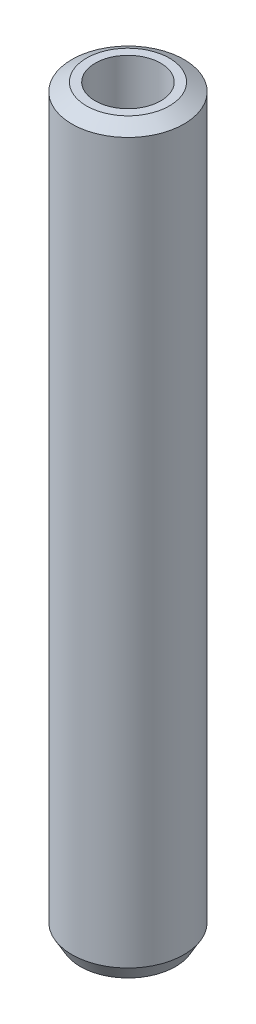
ISO-10303-21;
HEADER;
FILE_DESCRIPTION(('STEP AP214'),'2;1');
FILE_NAME('part.step','',(''),(''),'','','');
FILE_SCHEMA(('AUTOMOTIVE_DESIGN { 1 0 10303 214 1 1 1 1 }'));
ENDSEC;
DATA;
#1=APPLICATION_CONTEXT('core data for automotive mechanical design processes');
#2=APPLICATION_PROTOCOL_DEFINITION('international standard','automotive_design',2000,#1);
#3=PRODUCT_CONTEXT('',#1,'mechanical');
#4=PRODUCT('Part','Part','',(#3));
#5=PRODUCT_RELATED_PRODUCT_CATEGORY('part','',(#4));
#6=PRODUCT_DEFINITION_FORMATION('','',#4);
#7=PRODUCT_DEFINITION_CONTEXT('part definition',#1,'design');
#8=PRODUCT_DEFINITION('design','',#6,#7);
#9=PRODUCT_DEFINITION_SHAPE('','',#8);
#10=(LENGTH_UNIT() NAMED_UNIT(*) SI_UNIT(.MILLI.,.METRE.));
#11=(NAMED_UNIT(*) PLANE_ANGLE_UNIT() SI_UNIT($,.RADIAN.));
#12=(NAMED_UNIT(*) SI_UNIT($,.STERADIAN.) SOLID_ANGLE_UNIT());
#13=UNCERTAINTY_MEASURE_WITH_UNIT(LENGTH_MEASURE(1.E-05),#10,'distance_accuracy_value','');
#14=(GEOMETRIC_REPRESENTATION_CONTEXT(3) GLOBAL_UNCERTAINTY_ASSIGNED_CONTEXT((#13)) GLOBAL_UNIT_ASSIGNED_CONTEXT((#10,
#11,#12)) REPRESENTATION_CONTEXT('',''));
#15=CARTESIAN_POINT('',(0.,0.,0.));
#16=DIRECTION('',(0.,0.,1.));
#17=DIRECTION('',(1.,0.,0.));
#18=AXIS2_PLACEMENT_3D('',#15,#16,#17);
#19=CARTESIAN_POINT('',(0.,132.510919683854,0.));
#20=DIRECTION('',(0.,-1.,0.));
#21=DIRECTION('',(0.,0.,-1.));
#22=AXIS2_PLACEMENT_3D('',#19,#20,#21);
#23=CYLINDRICAL_SURFACE('',#22,10.);
#24=CARTESIAN_POINT('',(0.,131.008817441883,0.));
#25=DIRECTION('',(0.,1.,0.));
#26=DIRECTION('',(0.,0.,1.));
#27=AXIS2_PLACEMENT_3D('',#24,#25,#26);
#28=CIRCLE('',#27,10.);
#29=CARTESIAN_POINT('',(0.,131.008817441883,10.));
#30=VERTEX_POINT('',#29);
#31=EDGE_CURVE('E50',#30,#30,#28,.F.);
#32=ORIENTED_EDGE('',*,*,#31,.T.);
#33=EDGE_LOOP('',(#32));
#34=FACE_BOUND('',#33,.T.);
#35=CARTESIAN_POINT('',(0.,2.60171740125673,0.));
#36=DIRECTION('',(0.,1.,0.));
#37=DIRECTION('',(0.,0.,1.));
#38=AXIS2_PLACEMENT_3D('',#35,#36,#37);
#39=CIRCLE('',#38,10.);
#40=CARTESIAN_POINT('',(0.,2.60171740125673,10.));
#41=VERTEX_POINT('',#40);
#42=EDGE_CURVE('E51',#41,#41,#39,.T.);
#43=ORIENTED_EDGE('',*,*,#42,.T.);
#44=EDGE_LOOP('',(#43));
#45=FACE_BOUND('',#44,.T.);
#46=ADVANCED_FACE('F39',(#34,#45),#23,.T.);
#47=CARTESIAN_POINT('',(0.,132.510919683854,0.));
#48=DIRECTION('',(0.,1.,0.));
#49=DIRECTION('',(0.,0.,1.));
#50=AXIS2_PLACEMENT_3D('',#47,#48,#49);
#51=PLANE('',#50);
#52=CARTESIAN_POINT('',(0.,132.510919683854,0.));
#53=DIRECTION('',(0.,1.,0.));
#54=DIRECTION('',(0.,0.,1.));
#55=AXIS2_PLACEMENT_3D('',#52,#53,#54);
#56=CIRCLE('',#55,7.39828259874323);
#57=CARTESIAN_POINT('',(0.,132.510919683854,7.39828259874323));
#58=VERTEX_POINT('',#57);
#59=EDGE_CURVE('E54',#58,#58,#56,.T.);
#60=ORIENTED_EDGE('',*,*,#59,.T.);
#61=EDGE_LOOP('',(#60));
#62=FACE_BOUND('',#61,.T.);
#63=CARTESIAN_POINT('',(0.,132.510919683854,0.));
#64=DIRECTION('',(0.,1.,0.));
#65=DIRECTION('',(0.,0.,1.));
#66=AXIS2_PLACEMENT_3D('',#63,#64,#65);
#67=CIRCLE('',#66,5.84499284663869);
#68=CARTESIAN_POINT('',(0.,132.510919683854,5.84499284663869));
#69=VERTEX_POINT('',#68);
#70=EDGE_CURVE('E58',#69,#69,#67,.T.);
#71=ORIENTED_EDGE('',*,*,#70,.F.);
#72=EDGE_LOOP('',(#71));
#73=FACE_BOUND('',#72,.T.);
#74=ADVANCED_FACE('F69',(#62,#73),#51,.T.);
#75=CARTESIAN_POINT('',(0.,0.,0.));
#76=DIRECTION('',(0.,1.,0.));
#77=DIRECTION('',(0.,0.,1.));
#78=AXIS2_PLACEMENT_3D('',#75,#76,#77);
#79=PLANE('',#78);
#80=CARTESIAN_POINT('',(0.,0.,0.));
#81=DIRECTION('',(0.,1.,0.));
#82=DIRECTION('',(0.,0.,1.));
#83=AXIS2_PLACEMENT_3D('',#80,#81,#82);
#84=CIRCLE('',#83,8.49789775802908);
#85=CARTESIAN_POINT('',(0.,0.,8.49789775802908));
#86=VERTEX_POINT('',#85);
#87=EDGE_CURVE('E10',#86,#86,#84,.F.);
#88=ORIENTED_EDGE('',*,*,#87,.T.);
#89=EDGE_LOOP('',(#88));
#90=FACE_BOUND('',#89,.T.);
#91=CARTESIAN_POINT('',(0.,0.,0.));
#92=DIRECTION('',(0.,1.,0.));
#93=DIRECTION('',(0.,0.,1.));
#94=AXIS2_PLACEMENT_3D('',#91,#92,#93);
#95=CIRCLE('',#94,5.84499284663869);
#96=CARTESIAN_POINT('',(0.,0.,5.84499284663869));
#97=VERTEX_POINT('',#96);
#98=EDGE_CURVE('E63',#97,#97,#95,.T.);
#99=ORIENTED_EDGE('',*,*,#98,.T.);
#100=EDGE_LOOP('',(#99));
#101=FACE_BOUND('',#100,.T.);
#102=ADVANCED_FACE('F75',(#90,#101),#79,.F.);
#103=CARTESIAN_POINT('',(0.,132.510919683854,0.));
#104=DIRECTION('',(0.,-1.,0.));
#105=DIRECTION('',(0.,0.,-1.));
#106=AXIS2_PLACEMENT_3D('',#103,#104,#105);
#107=CYLINDRICAL_SURFACE('',#106,5.84499284663869);
#108=ORIENTED_EDGE('',*,*,#70,.T.);
#109=EDGE_LOOP('',(#108));
#110=FACE_BOUND('',#109,.T.);
#111=ORIENTED_EDGE('',*,*,#98,.F.);
#112=EDGE_LOOP('',(#111));
#113=FACE_BOUND('',#112,.T.);
#114=ADVANCED_FACE('F70',(#110,#113),#107,.F.);
#115=CARTESIAN_POINT('',(0.,132.510919683854,0.));
#116=DIRECTION('',(0.,-1.,0.));
#117=DIRECTION('',(0.,0.,-1.));
#118=AXIS2_PLACEMENT_3D('',#115,#116,#117);
#119=CONICAL_SURFACE('',#118,7.39828259874323,1.0471975511966);
#120=ORIENTED_EDGE('',*,*,#31,.F.);
#121=EDGE_LOOP('',(#120));
#122=FACE_BOUND('',#121,.T.);
#123=ORIENTED_EDGE('',*,*,#59,.F.);
#124=EDGE_LOOP('',(#123));
#125=FACE_BOUND('',#124,.T.);
#126=ADVANCED_FACE('F81',(#122,#125),#119,.T.);
#127=CARTESIAN_POINT('',(0.,2.60171740125673,0.));
#128=DIRECTION('',(0.,1.,0.));
#129=DIRECTION('',(0.,0.,1.));
#130=AXIS2_PLACEMENT_3D('',#127,#128,#129);
#131=CONICAL_SURFACE('',#130,10.,0.523598775598303);
#132=ORIENTED_EDGE('',*,*,#87,.F.);
#133=EDGE_LOOP('',(#132));
#134=FACE_BOUND('',#133,.T.);
#135=ORIENTED_EDGE('',*,*,#42,.F.);
#136=EDGE_LOOP('',(#135));
#137=FACE_BOUND('',#136,.T.);
#138=ADVANCED_FACE('F45',(#134,#137),#131,.T.);
#139=CLOSED_SHELL('',(#46,#74,#102,#114,#126,#138));
#140=MANIFOLD_SOLID_BREP('B2',#139);
#141=ADVANCED_BREP_SHAPE_REPRESENTATION('',(#18,#140),#14);
#142=SHAPE_DEFINITION_REPRESENTATION(#9,#141);
ENDSEC;
END-ISO-10303-21;
